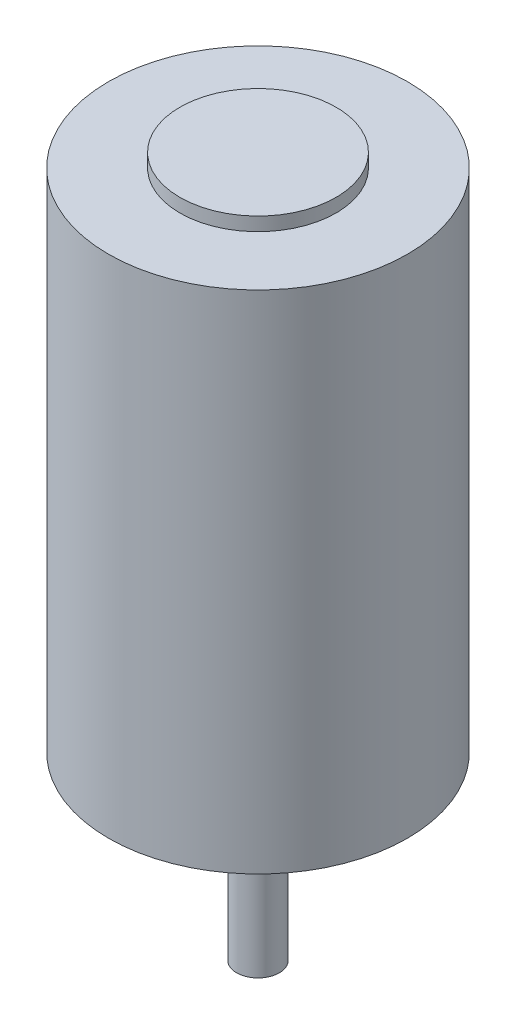
ISO-10303-21;
HEADER;
FILE_DESCRIPTION(('STEP AP214'),'2;1');
FILE_NAME('part.step','',(''),(''),'','','');
FILE_SCHEMA(('AUTOMOTIVE_DESIGN { 1 0 10303 214 1 1 1 1 }'));
ENDSEC;
DATA;
#1=APPLICATION_CONTEXT('core data for automotive mechanical design processes');
#2=APPLICATION_PROTOCOL_DEFINITION('international standard','automotive_design',2000,#1);
#3=PRODUCT_CONTEXT('',#1,'mechanical');
#4=PRODUCT('Part','Part','',(#3));
#5=PRODUCT_RELATED_PRODUCT_CATEGORY('part','',(#4));
#6=PRODUCT_DEFINITION_FORMATION('','',#4);
#7=PRODUCT_DEFINITION_CONTEXT('part definition',#1,'design');
#8=PRODUCT_DEFINITION('design','',#6,#7);
#9=PRODUCT_DEFINITION_SHAPE('','',#8);
#10=(LENGTH_UNIT() NAMED_UNIT(*) SI_UNIT(.MILLI.,.METRE.));
#11=(NAMED_UNIT(*) PLANE_ANGLE_UNIT() SI_UNIT($,.RADIAN.));
#12=(NAMED_UNIT(*) SI_UNIT($,.STERADIAN.) SOLID_ANGLE_UNIT());
#13=UNCERTAINTY_MEASURE_WITH_UNIT(LENGTH_MEASURE(1.E-05),#10,'distance_accuracy_value','');
#14=(GEOMETRIC_REPRESENTATION_CONTEXT(3) GLOBAL_UNCERTAINTY_ASSIGNED_CONTEXT((#13)) GLOBAL_UNIT_ASSIGNED_CONTEXT((#10,
#11,#12)) REPRESENTATION_CONTEXT('',''));
#15=CARTESIAN_POINT('',(0.,0.,0.));
#16=DIRECTION('',(0.,0.,1.));
#17=DIRECTION('',(1.,0.,0.));
#18=AXIS2_PLACEMENT_3D('',#15,#16,#17);
#19=CARTESIAN_POINT('',(0.,71.12,0.));
#20=DIRECTION('',(0.,-1.,0.));
#21=DIRECTION('',(0.,0.,-1.));
#22=AXIS2_PLACEMENT_3D('',#19,#20,#21);
#23=CYLINDRICAL_SURFACE('',#22,21.0185);
#24=CARTESIAN_POINT('',(0.,71.12,0.));
#25=DIRECTION('',(0.,1.,0.));
#26=DIRECTION('',(0.,0.,1.));
#27=AXIS2_PLACEMENT_3D('',#24,#25,#26);
#28=CIRCLE('',#27,21.0185);
#29=CARTESIAN_POINT('',(0.,71.12,21.0185));
#30=VERTEX_POINT('',#29);
#31=EDGE_CURVE('E62',#30,#30,#28,.T.);
#32=ORIENTED_EDGE('',*,*,#31,.F.);
#33=EDGE_LOOP('',(#32));
#34=FACE_BOUND('',#33,.T.);
#35=CARTESIAN_POINT('',(0.,0.,0.));
#36=DIRECTION('',(0.,1.,0.));
#37=DIRECTION('',(0.,0.,1.));
#38=AXIS2_PLACEMENT_3D('',#35,#36,#37);
#39=CIRCLE('',#38,21.0185);
#40=CARTESIAN_POINT('',(0.,0.,21.0185));
#41=VERTEX_POINT('',#40);
#42=EDGE_CURVE('E65',#41,#41,#39,.T.);
#43=ORIENTED_EDGE('',*,*,#42,.T.);
#44=EDGE_LOOP('',(#43));
#45=FACE_BOUND('',#44,.T.);
#46=ADVANCED_FACE('F44',(#34,#45),#23,.T.);
#47=CARTESIAN_POINT('',(0.,71.12,0.));
#48=DIRECTION('',(0.,1.,0.));
#49=DIRECTION('',(0.,0.,1.));
#50=AXIS2_PLACEMENT_3D('',#47,#48,#49);
#51=PLANE('',#50);
#52=CARTESIAN_POINT('',(0.,71.12,0.));
#53=DIRECTION('',(0.,1.,0.));
#54=DIRECTION('',(0.,0.,1.));
#55=AXIS2_PLACEMENT_3D('',#52,#53,#54);
#56=CIRCLE('',#55,10.9855);
#57=CARTESIAN_POINT('',(0.,71.12,10.9855));
#58=VERTEX_POINT('',#57);
#59=EDGE_CURVE('E56',#58,#58,#56,.T.);
#60=ORIENTED_EDGE('',*,*,#59,.F.);
#61=EDGE_LOOP('',(#60));
#62=FACE_BOUND('',#61,.T.);
#63=ORIENTED_EDGE('',*,*,#31,.T.);
#64=EDGE_LOOP('',(#63));
#65=FACE_BOUND('',#64,.T.);
#66=ADVANCED_FACE('F118',(#62,#65),#51,.T.);
#67=CARTESIAN_POINT('',(0.,0.,0.));
#68=DIRECTION('',(0.,1.,0.));
#69=DIRECTION('',(0.,0.,1.));
#70=AXIS2_PLACEMENT_3D('',#67,#68,#69);
#71=PLANE('',#70);
#72=CARTESIAN_POINT('',(15.875,0.,0.));
#73=DIRECTION('',(0.,-1.,0.));
#74=DIRECTION('',(0.,0.,-1.));
#75=AXIS2_PLACEMENT_3D('',#72,#73,#74);
#76=CIRCLE('',#75,1.27);
#77=CARTESIAN_POINT('',(15.875,0.,-1.27));
#78=VERTEX_POINT('',#77);
#79=EDGE_CURVE('E86',#78,#78,#76,.T.);
#80=ORIENTED_EDGE('',*,*,#79,.F.);
#81=EDGE_LOOP('',(#80));
#82=FACE_BOUND('',#81,.T.);
#83=CARTESIAN_POINT('',(-15.875,0.,0.));
#84=DIRECTION('',(0.,-1.,0.));
#85=DIRECTION('',(0.,0.,1.));
#86=AXIS2_PLACEMENT_3D('',#83,#84,#85);
#87=CIRCLE('',#86,1.27);
#88=CARTESIAN_POINT('',(-15.875,0.,1.27));
#89=VERTEX_POINT('',#88);
#90=EDGE_CURVE('E280',#89,#89,#87,.T.);
#91=ORIENTED_EDGE('',*,*,#90,.F.);
#92=EDGE_LOOP('',(#91));
#93=FACE_BOUND('',#92,.T.);
#94=CARTESIAN_POINT('',(0.,0.,0.));
#95=DIRECTION('',(0.,1.,0.));
#96=DIRECTION('',(0.,0.,1.));
#97=AXIS2_PLACEMENT_3D('',#94,#95,#96);
#98=CIRCLE('',#97,10.9855);
#99=CARTESIAN_POINT('',(0.,0.,10.9855));
#100=VERTEX_POINT('',#99);
#101=EDGE_CURVE('E51',#100,#100,#98,.F.);
#102=ORIENTED_EDGE('',*,*,#101,.F.);
#103=EDGE_LOOP('',(#102));
#104=FACE_BOUND('',#103,.T.);
#105=ORIENTED_EDGE('',*,*,#42,.F.);
#106=EDGE_LOOP('',(#105));
#107=FACE_BOUND('',#106,.T.);
#108=ADVANCED_FACE('F115',(#82,#93,#104,#107),#71,.F.);
#109=CARTESIAN_POINT('',(0.,73.025,0.));
#110=DIRECTION('',(0.,-1.,0.));
#111=DIRECTION('',(0.,0.,-1.));
#112=AXIS2_PLACEMENT_3D('',#109,#110,#111);
#113=CYLINDRICAL_SURFACE('',#112,10.9855);
#114=CARTESIAN_POINT('',(0.,73.025,0.));
#115=DIRECTION('',(0.,1.,0.));
#116=DIRECTION('',(0.,0.,1.));
#117=AXIS2_PLACEMENT_3D('',#114,#115,#116);
#118=CIRCLE('',#117,10.9855);
#119=CARTESIAN_POINT('',(0.,73.025,10.9855));
#120=VERTEX_POINT('',#119);
#121=EDGE_CURVE('E103',#120,#120,#118,.T.);
#122=ORIENTED_EDGE('',*,*,#121,.F.);
#123=EDGE_LOOP('',(#122));
#124=FACE_BOUND('',#123,.T.);
#125=ORIENTED_EDGE('',*,*,#59,.T.);
#126=EDGE_LOOP('',(#125));
#127=FACE_BOUND('',#126,.T.);
#128=ADVANCED_FACE('F117',(#124,#127),#113,.T.);
#129=CARTESIAN_POINT('',(0.,73.025,0.));
#130=DIRECTION('',(0.,1.,0.));
#131=DIRECTION('',(0.,0.,1.));
#132=AXIS2_PLACEMENT_3D('',#129,#130,#131);
#133=PLANE('',#132);
#134=ORIENTED_EDGE('',*,*,#121,.T.);
#135=EDGE_LOOP('',(#134));
#136=FACE_BOUND('',#135,.T.);
#137=ADVANCED_FACE('F125',(#136),#133,.T.);
#138=CARTESIAN_POINT('',(0.,-1.905,0.));
#139=DIRECTION('',(0.,-1.,0.));
#140=DIRECTION('',(0.,0.,-1.));
#141=AXIS2_PLACEMENT_3D('',#138,#139,#140);
#142=PLANE('',#141);
#143=CARTESIAN_POINT('',(0.,-1.905,0.));
#144=DIRECTION('',(0.,-1.,0.));
#145=DIRECTION('',(0.,0.,-1.));
#146=AXIS2_PLACEMENT_3D('',#143,#144,#145);
#147=CIRCLE('',#146,10.9855);
#148=CARTESIAN_POINT('',(0.,-1.905,-10.9855));
#149=VERTEX_POINT('',#148);
#150=EDGE_CURVE('E96',#149,#149,#147,.T.);
#151=ORIENTED_EDGE('',*,*,#150,.T.);
#152=EDGE_LOOP('',(#151));
#153=FACE_BOUND('',#152,.T.);
#154=CARTESIAN_POINT('',(0.,-1.905,0.));
#155=DIRECTION('',(0.,-1.,0.));
#156=DIRECTION('',(0.,0.,-1.));
#157=AXIS2_PLACEMENT_3D('',#154,#155,#156);
#158=CIRCLE('',#157,8.4455);
#159=CARTESIAN_POINT('',(0.,-1.905,-8.4455));
#160=VERTEX_POINT('',#159);
#161=EDGE_CURVE('E92',#160,#160,#158,.T.);
#162=ORIENTED_EDGE('',*,*,#161,.F.);
#163=EDGE_LOOP('',(#162));
#164=FACE_BOUND('',#163,.T.);
#165=ADVANCED_FACE('F156',(#153,#164),#142,.T.);
#166=CARTESIAN_POINT('',(0.,-1.905,0.));
#167=DIRECTION('',(0.,1.,0.));
#168=DIRECTION('',(0.,0.,1.));
#169=AXIS2_PLACEMENT_3D('',#166,#167,#168);
#170=CYLINDRICAL_SURFACE('',#169,10.9855);
#171=ORIENTED_EDGE('',*,*,#150,.F.);
#172=EDGE_LOOP('',(#171));
#173=FACE_BOUND('',#172,.T.);
#174=ORIENTED_EDGE('',*,*,#101,.T.);
#175=EDGE_LOOP('',(#174));
#176=FACE_BOUND('',#175,.T.);
#177=ADVANCED_FACE('F166',(#173,#176),#170,.T.);
#178=CARTESIAN_POINT('',(0.,-1.905,0.));
#179=DIRECTION('',(0.,1.,0.));
#180=DIRECTION('',(0.,0.,1.));
#181=AXIS2_PLACEMENT_3D('',#178,#179,#180);
#182=CYLINDRICAL_SURFACE('',#181,8.4455);
#183=ORIENTED_EDGE('',*,*,#161,.T.);
#184=EDGE_LOOP('',(#183));
#185=FACE_BOUND('',#184,.T.);
#186=CARTESIAN_POINT('',(0.,0.,0.));
#187=DIRECTION('',(0.,-1.,0.));
#188=DIRECTION('',(0.,0.,-1.));
#189=AXIS2_PLACEMENT_3D('',#186,#187,#188);
#190=CIRCLE('',#189,8.4455);
#191=CARTESIAN_POINT('',(0.,0.,-8.4455));
#192=VERTEX_POINT('',#191);
#193=EDGE_CURVE('E77',#192,#192,#190,.T.);
#194=ORIENTED_EDGE('',*,*,#193,.F.);
#195=EDGE_LOOP('',(#194));
#196=FACE_BOUND('',#195,.T.);
#197=ADVANCED_FACE('F133',(#185,#196),#182,.F.);
#198=CARTESIAN_POINT('',(0.,0.,0.));
#199=DIRECTION('',(0.,1.,0.));
#200=DIRECTION('',(0.,0.,1.));
#201=AXIS2_PLACEMENT_3D('',#198,#199,#200);
#202=CIRCLE('',#201,5.08);
#203=CARTESIAN_POINT('',(0.,0.,5.08));
#204=VERTEX_POINT('',#203);
#205=EDGE_CURVE('E10',#204,#204,#202,.F.);
#206=ORIENTED_EDGE('',*,*,#205,.F.);
#207=EDGE_LOOP('',(#206));
#208=FACE_BOUND('',#207,.T.);
#209=ORIENTED_EDGE('',*,*,#193,.T.);
#210=EDGE_LOOP('',(#209));
#211=FACE_BOUND('',#210,.T.);
#212=ADVANCED_FACE('F120',(#208,#211),#71,.F.);
#213=CARTESIAN_POINT('',(0.,-3.429,0.));
#214=DIRECTION('',(0.,1.,0.));
#215=DIRECTION('',(0.,0.,1.));
#216=AXIS2_PLACEMENT_3D('',#213,#214,#215);
#217=CYLINDRICAL_SURFACE('',#216,5.08);
#218=CARTESIAN_POINT('',(0.,-3.429,0.));
#219=DIRECTION('',(0.,-1.,0.));
#220=DIRECTION('',(0.,0.,-1.));
#221=AXIS2_PLACEMENT_3D('',#218,#219,#220);
#222=CIRCLE('',#221,5.08);
#223=CARTESIAN_POINT('',(0.,-3.429,-5.08));
#224=VERTEX_POINT('',#223);
#225=EDGE_CURVE('E71',#224,#224,#222,.T.);
#226=ORIENTED_EDGE('',*,*,#225,.F.);
#227=EDGE_LOOP('',(#226));
#228=FACE_BOUND('',#227,.T.);
#229=ORIENTED_EDGE('',*,*,#205,.T.);
#230=EDGE_LOOP('',(#229));
#231=FACE_BOUND('',#230,.T.);
#232=ADVANCED_FACE('F132',(#228,#231),#217,.T.);
#233=CARTESIAN_POINT('',(0.,-3.429,0.));
#234=DIRECTION('',(0.,-1.,0.));
#235=DIRECTION('',(0.,0.,-1.));
#236=AXIS2_PLACEMENT_3D('',#233,#234,#235);
#237=PLANE('',#236);
#238=CARTESIAN_POINT('',(0.,-3.429,0.));
#239=DIRECTION('',(0.,-1.,0.));
#240=DIRECTION('',(0.,0.,-1.));
#241=AXIS2_PLACEMENT_3D('',#238,#239,#240);
#242=CIRCLE('',#241,3.);
#243=CARTESIAN_POINT('',(0.,-3.429,-3.));
#244=VERTEX_POINT('',#243);
#245=EDGE_CURVE('E67',#244,#244,#242,.T.);
#246=ORIENTED_EDGE('',*,*,#245,.F.);
#247=EDGE_LOOP('',(#246));
#248=FACE_BOUND('',#247,.T.);
#249=ORIENTED_EDGE('',*,*,#225,.T.);
#250=EDGE_LOOP('',(#249));
#251=FACE_BOUND('',#250,.T.);
#252=ADVANCED_FACE('F194',(#248,#251),#237,.T.);
#253=CARTESIAN_POINT('',(0.,-25.4,0.));
#254=DIRECTION('',(0.,-1.,0.));
#255=DIRECTION('',(0.,0.,-1.));
#256=AXIS2_PLACEMENT_3D('',#253,#254,#255);
#257=PLANE('',#256);
#258=CARTESIAN_POINT('',(0.,-25.4,0.));
#259=DIRECTION('',(0.,-1.,0.));
#260=DIRECTION('',(0.,0.,-1.));
#261=AXIS2_PLACEMENT_3D('',#258,#259,#260);
#262=CIRCLE('',#261,3.);
#263=CARTESIAN_POINT('',(0.,-25.4,-3.));
#264=VERTEX_POINT('',#263);
#265=EDGE_CURVE('E70',#264,#264,#262,.T.);
#266=ORIENTED_EDGE('',*,*,#265,.T.);
#267=EDGE_LOOP('',(#266));
#268=FACE_BOUND('',#267,.T.);
#269=ADVANCED_FACE('F189',(#268),#257,.T.);
#270=CARTESIAN_POINT('',(0.,-25.4,0.));
#271=DIRECTION('',(0.,1.,0.));
#272=DIRECTION('',(0.,0.,1.));
#273=AXIS2_PLACEMENT_3D('',#270,#271,#272);
#274=CYLINDRICAL_SURFACE('',#273,3.);
#275=ORIENTED_EDGE('',*,*,#245,.T.);
#276=EDGE_LOOP('',(#275));
#277=FACE_BOUND('',#276,.T.);
#278=ORIENTED_EDGE('',*,*,#265,.F.);
#279=EDGE_LOOP('',(#278));
#280=FACE_BOUND('',#279,.T.);
#281=ADVANCED_FACE('F193',(#277,#280),#274,.T.);
#282=CARTESIAN_POINT('',(-15.875,5.08,0.));
#283=DIRECTION('',(0.,-1.,0.));
#284=DIRECTION('',(0.,0.,-1.));
#285=AXIS2_PLACEMENT_3D('',#282,#283,#284);
#286=CYLINDRICAL_SURFACE('',#285,1.27);
#287=CARTESIAN_POINT('',(-15.875,5.08,0.));
#288=DIRECTION('',(0.,-1.,0.));
#289=DIRECTION('',(0.,0.,1.));
#290=AXIS2_PLACEMENT_3D('',#287,#288,#289);
#291=CIRCLE('',#290,1.27);
#292=CARTESIAN_POINT('',(-15.875,5.08,1.27));
#293=VERTEX_POINT('',#292);
#294=EDGE_CURVE('E89',#293,#293,#291,.T.);
#295=ORIENTED_EDGE('',*,*,#294,.F.);
#296=EDGE_LOOP('',(#295));
#297=FACE_BOUND('',#296,.T.);
#298=ORIENTED_EDGE('',*,*,#90,.T.);
#299=EDGE_LOOP('',(#298));
#300=FACE_BOUND('',#299,.T.);
#301=ADVANCED_FACE('F222',(#297,#300),#286,.F.);
#302=CARTESIAN_POINT('',(-15.875,5.08,0.));
#303=DIRECTION('',(0.,1.,0.));
#304=DIRECTION('',(0.,0.,1.));
#305=AXIS2_PLACEMENT_3D('',#302,#303,#304);
#306=PLANE('',#305);
#307=ORIENTED_EDGE('',*,*,#294,.T.);
#308=EDGE_LOOP('',(#307));
#309=FACE_BOUND('',#308,.T.);
#310=ADVANCED_FACE('F234',(#309),#306,.F.);
#311=CARTESIAN_POINT('',(15.875,5.08,0.));
#312=DIRECTION('',(0.,-1.,0.));
#313=DIRECTION('',(0.,0.,-1.));
#314=AXIS2_PLACEMENT_3D('',#311,#312,#313);
#315=CYLINDRICAL_SURFACE('',#314,1.27);
#316=CARTESIAN_POINT('',(15.875,5.08,0.));
#317=DIRECTION('',(0.,-1.,0.));
#318=DIRECTION('',(0.,0.,-1.));
#319=AXIS2_PLACEMENT_3D('',#316,#317,#318);
#320=CIRCLE('',#319,1.27);
#321=CARTESIAN_POINT('',(15.875,5.08,-1.27));
#322=VERTEX_POINT('',#321);
#323=EDGE_CURVE('E80',#322,#322,#320,.T.);
#324=ORIENTED_EDGE('',*,*,#323,.F.);
#325=EDGE_LOOP('',(#324));
#326=FACE_BOUND('',#325,.T.);
#327=ORIENTED_EDGE('',*,*,#79,.T.);
#328=EDGE_LOOP('',(#327));
#329=FACE_BOUND('',#328,.T.);
#330=ADVANCED_FACE('F243',(#326,#329),#315,.F.);
#331=CARTESIAN_POINT('',(15.875,5.08,0.));
#332=DIRECTION('',(0.,-1.,0.));
#333=DIRECTION('',(0.,0.,-1.));
#334=AXIS2_PLACEMENT_3D('',#331,#332,#333);
#335=PLANE('',#334);
#336=ORIENTED_EDGE('',*,*,#323,.T.);
#337=EDGE_LOOP('',(#336));
#338=FACE_BOUND('',#337,.T.);
#339=ADVANCED_FACE('F252',(#338),#335,.T.);
#340=CLOSED_SHELL('',(#46,#66,#108,#128,#137,#165,#177,#197,#212,#232,#252,#269,#281,#301,#310,
#330,#339));
#341=MANIFOLD_SOLID_BREP('B2',#340);
#342=ADVANCED_BREP_SHAPE_REPRESENTATION('',(#18,#341),#14);
#343=SHAPE_DEFINITION_REPRESENTATION(#9,#342);
ENDSEC;
END-ISO-10303-21;
